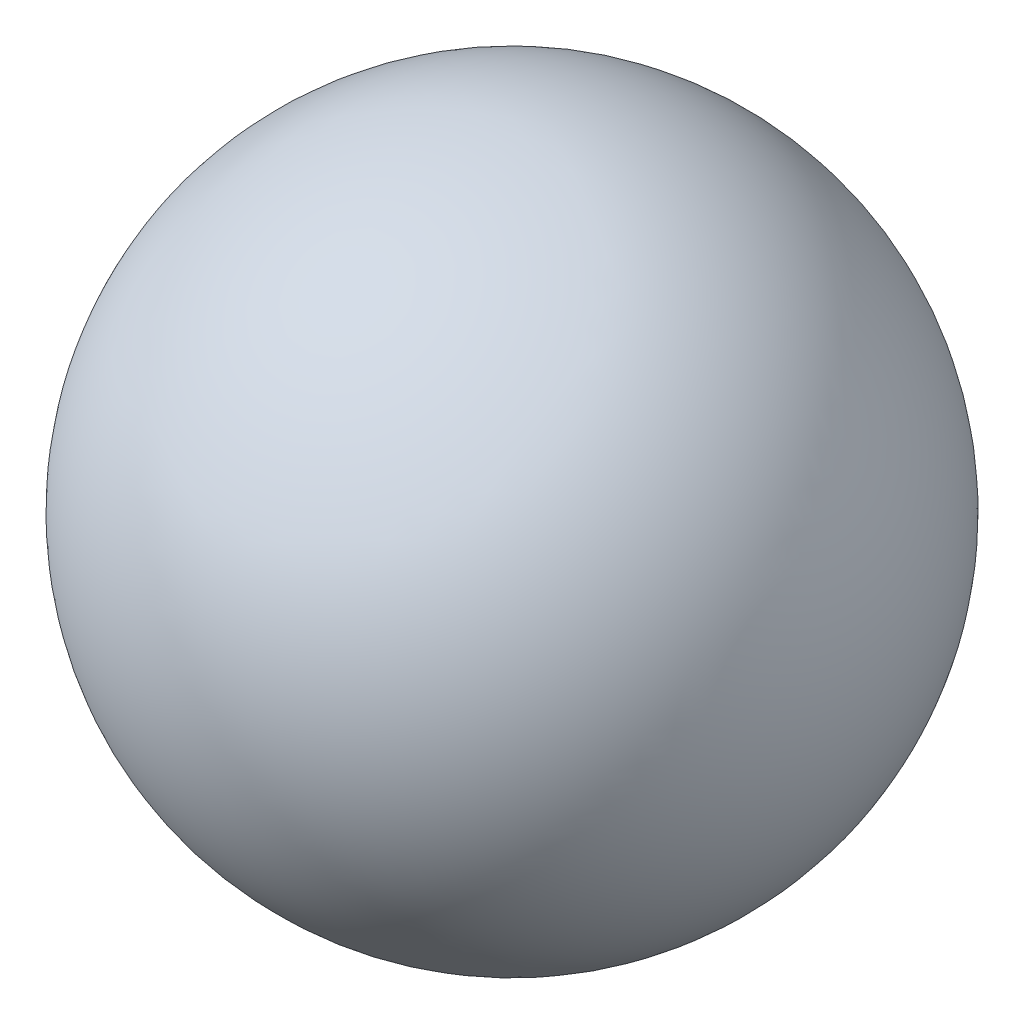
ISO-10303-21;
HEADER;
FILE_DESCRIPTION(('STEP AP214'),'2;1');
FILE_NAME('part.step','',(''),(''),'','','');
FILE_SCHEMA(('AUTOMOTIVE_DESIGN { 1 0 10303 214 1 1 1 1 }'));
ENDSEC;
DATA;
#1=APPLICATION_CONTEXT('core data for automotive mechanical design processes');
#2=APPLICATION_PROTOCOL_DEFINITION('international standard','automotive_design',2000,#1);
#3=PRODUCT_CONTEXT('',#1,'mechanical');
#4=PRODUCT('Part','Part','',(#3));
#5=PRODUCT_RELATED_PRODUCT_CATEGORY('part','',(#4));
#6=PRODUCT_DEFINITION_FORMATION('','',#4);
#7=PRODUCT_DEFINITION_CONTEXT('part definition',#1,'design');
#8=PRODUCT_DEFINITION('design','',#6,#7);
#9=PRODUCT_DEFINITION_SHAPE('','',#8);
#10=(LENGTH_UNIT() NAMED_UNIT(*) SI_UNIT(.MILLI.,.METRE.));
#11=(NAMED_UNIT(*) PLANE_ANGLE_UNIT() SI_UNIT($,.RADIAN.));
#12=(NAMED_UNIT(*) SI_UNIT($,.STERADIAN.) SOLID_ANGLE_UNIT());
#13=UNCERTAINTY_MEASURE_WITH_UNIT(LENGTH_MEASURE(1.E-05),#10,'distance_accuracy_value','');
#14=(GEOMETRIC_REPRESENTATION_CONTEXT(3) GLOBAL_UNCERTAINTY_ASSIGNED_CONTEXT((#13)) GLOBAL_UNIT_ASSIGNED_CONTEXT((#10,
#11,#12)) REPRESENTATION_CONTEXT('',''));
#15=CARTESIAN_POINT('',(0.,0.,0.));
#16=DIRECTION('',(0.,0.,1.));
#17=DIRECTION('',(1.,0.,0.));
#18=AXIS2_PLACEMENT_3D('',#15,#16,#17);
#19=CARTESIAN_POINT('',(0.,0.,0.));
#20=DIRECTION('',(-1.,0.,0.));
#21=DIRECTION('',(0.,0.,-1.));
#22=AXIS2_PLACEMENT_3D('',#19,#20,#21);
#23=SPHERICAL_SURFACE('',#22,2.9718);
#24=CARTESIAN_POINT('',(-2.9718,0.,0.));
#25=VERTEX_POINT('',#24);
#26=VERTEX_LOOP('',#25);
#27=FACE_BOUND('',#26,.T.);
#28=ADVANCED_FACE('F356',(#27),#23,.T.);
#29=CLOSED_SHELL('',(#28));
#30=MANIFOLD_SOLID_BREP('B2',#29);
#31=ADVANCED_BREP_SHAPE_REPRESENTATION('',(#18,#30),#14);
#32=SHAPE_DEFINITION_REPRESENTATION(#9,#31);
ENDSEC;
END-ISO-10303-21;
